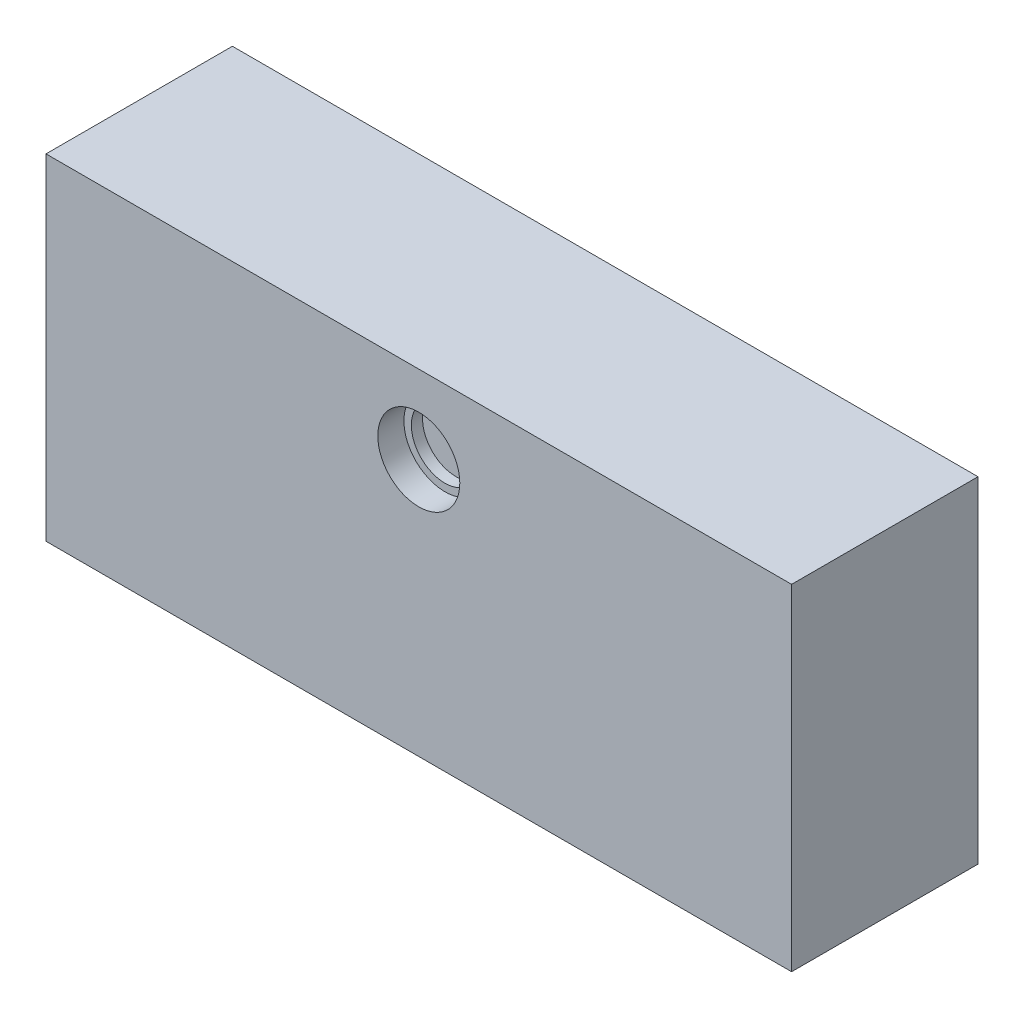
ISO-10303-21;
HEADER;
FILE_DESCRIPTION(('STEP AP214'),'2;1');
FILE_NAME('part.step','',(''),(''),'','','');
FILE_SCHEMA(('AUTOMOTIVE_DESIGN { 1 0 10303 214 1 1 1 1 }'));
ENDSEC;
DATA;
#1=APPLICATION_CONTEXT('core data for automotive mechanical design processes');
#2=APPLICATION_PROTOCOL_DEFINITION('international standard','automotive_design',2000,#1);
#3=PRODUCT_CONTEXT('',#1,'mechanical');
#4=PRODUCT('Part','Part','',(#3));
#5=PRODUCT_RELATED_PRODUCT_CATEGORY('part','',(#4));
#6=PRODUCT_DEFINITION_FORMATION('','',#4);
#7=PRODUCT_DEFINITION_CONTEXT('part definition',#1,'design');
#8=PRODUCT_DEFINITION('design','',#6,#7);
#9=PRODUCT_DEFINITION_SHAPE('','',#8);
#10=(LENGTH_UNIT() NAMED_UNIT(*) SI_UNIT(.MILLI.,.METRE.));
#11=(NAMED_UNIT(*) PLANE_ANGLE_UNIT() SI_UNIT($,.RADIAN.));
#12=(NAMED_UNIT(*) SI_UNIT($,.STERADIAN.) SOLID_ANGLE_UNIT());
#13=UNCERTAINTY_MEASURE_WITH_UNIT(LENGTH_MEASURE(1.E-05),#10,'distance_accuracy_value','');
#14=(GEOMETRIC_REPRESENTATION_CONTEXT(3) GLOBAL_UNCERTAINTY_ASSIGNED_CONTEXT((#13)) GLOBAL_UNIT_ASSIGNED_CONTEXT((#10,
#11,#12)) REPRESENTATION_CONTEXT('',''));
#15=CARTESIAN_POINT('',(0.,0.,0.));
#16=DIRECTION('',(0.,0.,1.));
#17=DIRECTION('',(1.,0.,0.));
#18=AXIS2_PLACEMENT_3D('',#15,#16,#17);
#19=CARTESIAN_POINT('',(-100.,-45.,25.));
#20=DIRECTION('',(1.,0.,0.));
#21=DIRECTION('',(0.,0.,-1.));
#22=AXIS2_PLACEMENT_3D('',#19,#20,#21);
#23=PLANE('',#22);
#24=DIRECTION('',(0.,-1.,0.));
#25=VECTOR('',#24,1.);
#26=CARTESIAN_POINT('',(-100.,-45.,-25.));
#27=LINE('',#26,#25);
#28=CARTESIAN_POINT('',(-100.,45.,-25.));
#29=VERTEX_POINT('',#28);
#30=CARTESIAN_POINT('',(-100.,-45.,-25.));
#31=VERTEX_POINT('',#30);
#32=EDGE_CURVE('E101',#29,#31,#27,.T.);
#33=ORIENTED_EDGE('',*,*,#32,.T.);
#34=DIRECTION('',(0.,0.,-1.));
#35=VECTOR('',#34,1.);
#36=CARTESIAN_POINT('',(-100.,-45.,25.));
#37=LINE('',#36,#35);
#38=CARTESIAN_POINT('',(-100.,-45.,25.));
#39=VERTEX_POINT('',#38);
#40=EDGE_CURVE('E11',#39,#31,#37,.T.);
#41=ORIENTED_EDGE('',*,*,#40,.F.);
#42=DIRECTION('',(0.,-1.,0.));
#43=VECTOR('',#42,1.);
#44=CARTESIAN_POINT('',(-100.,-45.,25.));
#45=LINE('',#44,#43);
#46=CARTESIAN_POINT('',(-100.,45.,25.));
#47=VERTEX_POINT('',#46);
#48=EDGE_CURVE('E89',#47,#39,#45,.T.);
#49=ORIENTED_EDGE('',*,*,#48,.F.);
#50=DIRECTION('',(0.,0.,-1.));
#51=VECTOR('',#50,1.);
#52=CARTESIAN_POINT('',(-100.,45.,25.));
#53=LINE('',#52,#51);
#54=EDGE_CURVE('E97',#47,#29,#53,.T.);
#55=ORIENTED_EDGE('',*,*,#54,.T.);
#56=EDGE_LOOP('',(#33,#41,#49,#55));
#57=FACE_BOUND('',#56,.T.);
#58=ADVANCED_FACE('F38',(#57),#23,.F.);
#59=CARTESIAN_POINT('',(100.,-45.,25.));
#60=DIRECTION('',(0.,1.,0.));
#61=DIRECTION('',(-1.,0.,0.));
#62=AXIS2_PLACEMENT_3D('',#59,#60,#61);
#63=PLANE('',#62);
#64=CARTESIAN_POINT('',(-50.,-45.,0.));
#65=DIRECTION('',(0.,-1.,0.));
#66=DIRECTION('',(1.,0.,0.));
#67=AXIS2_PLACEMENT_3D('',#64,#65,#66);
#68=CIRCLE('',#67,5.);
#69=CARTESIAN_POINT('',(-45.,-45.,0.));
#70=VERTEX_POINT('',#69);
#71=EDGE_CURVE('E134',#70,#70,#68,.T.);
#72=ORIENTED_EDGE('',*,*,#71,.F.);
#73=EDGE_LOOP('',(#72));
#74=FACE_BOUND('',#73,.T.);
#75=CARTESIAN_POINT('',(50.,-45.,0.));
#76=DIRECTION('',(0.,-1.,0.));
#77=DIRECTION('',(1.,0.,0.));
#78=AXIS2_PLACEMENT_3D('',#75,#76,#77);
#79=CIRCLE('',#78,5.);
#80=CARTESIAN_POINT('',(55.,-45.,0.));
#81=VERTEX_POINT('',#80);
#82=EDGE_CURVE('E127',#81,#81,#79,.T.);
#83=ORIENTED_EDGE('',*,*,#82,.F.);
#84=EDGE_LOOP('',(#83));
#85=FACE_BOUND('',#84,.T.);
#86=DIRECTION('',(1.,0.,0.));
#87=VECTOR('',#86,1.);
#88=CARTESIAN_POINT('',(100.,-45.,-25.));
#89=LINE('',#88,#87);
#90=CARTESIAN_POINT('',(100.,-45.,-25.));
#91=VERTEX_POINT('',#90);
#92=EDGE_CURVE('E93',#31,#91,#89,.T.);
#93=ORIENTED_EDGE('',*,*,#92,.T.);
#94=DIRECTION('',(0.,0.,-1.));
#95=VECTOR('',#94,1.);
#96=CARTESIAN_POINT('',(100.,-45.,25.));
#97=LINE('',#96,#95);
#98=CARTESIAN_POINT('',(100.,-45.,25.));
#99=VERTEX_POINT('',#98);
#100=EDGE_CURVE('E46',#99,#91,#97,.T.);
#101=ORIENTED_EDGE('',*,*,#100,.F.);
#102=DIRECTION('',(1.,0.,0.));
#103=VECTOR('',#102,1.);
#104=CARTESIAN_POINT('',(100.,-45.,25.));
#105=LINE('',#104,#103);
#106=EDGE_CURVE('E84',#39,#99,#105,.T.);
#107=ORIENTED_EDGE('',*,*,#106,.F.);
#108=ORIENTED_EDGE('',*,*,#40,.T.);
#109=EDGE_LOOP('',(#93,#101,#107,#108));
#110=FACE_BOUND('',#109,.T.);
#111=ADVANCED_FACE('F92',(#74,#85,#110),#63,.F.);
#112=CARTESIAN_POINT('',(100.,-45.,25.));
#113=DIRECTION('',(-1.,0.,0.));
#114=DIRECTION('',(0.,0.,1.));
#115=AXIS2_PLACEMENT_3D('',#112,#113,#114);
#116=PLANE('',#115);
#117=DIRECTION('',(0.,1.,0.));
#118=VECTOR('',#117,1.);
#119=CARTESIAN_POINT('',(100.,-45.,-25.));
#120=LINE('',#119,#118);
#121=CARTESIAN_POINT('',(100.,45.,-25.));
#122=VERTEX_POINT('',#121);
#123=EDGE_CURVE('E71',#91,#122,#120,.T.);
#124=ORIENTED_EDGE('',*,*,#123,.T.);
#125=DIRECTION('',(0.,0.,-1.));
#126=VECTOR('',#125,1.);
#127=CARTESIAN_POINT('',(100.,45.,25.));
#128=LINE('',#127,#126);
#129=CARTESIAN_POINT('',(100.,45.,25.));
#130=VERTEX_POINT('',#129);
#131=EDGE_CURVE('E94',#130,#122,#128,.T.);
#132=ORIENTED_EDGE('',*,*,#131,.F.);
#133=DIRECTION('',(0.,1.,0.));
#134=VECTOR('',#133,1.);
#135=CARTESIAN_POINT('',(100.,-45.,25.));
#136=LINE('',#135,#134);
#137=EDGE_CURVE('E87',#99,#130,#136,.T.);
#138=ORIENTED_EDGE('',*,*,#137,.F.);
#139=ORIENTED_EDGE('',*,*,#100,.T.);
#140=EDGE_LOOP('',(#124,#132,#138,#139));
#141=FACE_BOUND('',#140,.T.);
#142=ADVANCED_FACE('F95',(#141),#116,.F.);
#143=CARTESIAN_POINT('',(100.,45.,25.));
#144=DIRECTION('',(0.,-1.,0.));
#145=DIRECTION('',(1.,0.,0.));
#146=AXIS2_PLACEMENT_3D('',#143,#144,#145);
#147=PLANE('',#146);
#148=DIRECTION('',(-1.,0.,0.));
#149=VECTOR('',#148,1.);
#150=CARTESIAN_POINT('',(100.,45.,-25.));
#151=LINE('',#150,#149);
#152=EDGE_CURVE('E77',#122,#29,#151,.T.);
#153=ORIENTED_EDGE('',*,*,#152,.T.);
#154=ORIENTED_EDGE('',*,*,#54,.F.);
#155=DIRECTION('',(-1.,0.,0.));
#156=VECTOR('',#155,1.);
#157=CARTESIAN_POINT('',(100.,45.,25.));
#158=LINE('',#157,#156);
#159=EDGE_CURVE('E54',#130,#47,#158,.T.);
#160=ORIENTED_EDGE('',*,*,#159,.F.);
#161=ORIENTED_EDGE('',*,*,#131,.T.);
#162=EDGE_LOOP('',(#153,#154,#160,#161));
#163=FACE_BOUND('',#162,.T.);
#164=ADVANCED_FACE('F109',(#163),#147,.F.);
#165=CARTESIAN_POINT('',(0.,0.,25.));
#166=DIRECTION('',(0.,0.,1.));
#167=DIRECTION('',(1.,0.,0.));
#168=AXIS2_PLACEMENT_3D('',#165,#166,#167);
#169=PLANE('',#168);
#170=CARTESIAN_POINT('',(0.,24.,25.));
#171=DIRECTION('',(0.,0.,1.));
#172=DIRECTION('',(1.,0.,0.));
#173=AXIS2_PLACEMENT_3D('',#170,#171,#172);
#174=CIRCLE('',#173,11.);
#175=CARTESIAN_POINT('',(11.,24.,25.));
#176=VERTEX_POINT('',#175);
#177=EDGE_CURVE('E118',#176,#176,#174,.T.);
#178=ORIENTED_EDGE('',*,*,#177,.F.);
#179=EDGE_LOOP('',(#178));
#180=FACE_BOUND('',#179,.T.);
#181=ORIENTED_EDGE('',*,*,#48,.T.);
#182=ORIENTED_EDGE('',*,*,#106,.T.);
#183=ORIENTED_EDGE('',*,*,#137,.T.);
#184=ORIENTED_EDGE('',*,*,#159,.T.);
#185=EDGE_LOOP('',(#181,#182,#183,#184));
#186=FACE_BOUND('',#185,.T.);
#187=ADVANCED_FACE('F85',(#180,#186),#169,.T.);
#188=CARTESIAN_POINT('',(0.,0.,-25.));
#189=DIRECTION('',(0.,0.,1.));
#190=DIRECTION('',(1.,0.,0.));
#191=AXIS2_PLACEMENT_3D('',#188,#189,#190);
#192=PLANE('',#191);
#193=CARTESIAN_POINT('',(50.,-5.00000000000001,-25.));
#194=DIRECTION('',(0.,0.,-1.));
#195=DIRECTION('',(-1.,0.,0.));
#196=AXIS2_PLACEMENT_3D('',#193,#194,#195);
#197=CIRCLE('',#196,5.);
#198=CARTESIAN_POINT('',(45.,-5.00000000000001,-25.));
#199=VERTEX_POINT('',#198);
#200=EDGE_CURVE('E145',#199,#199,#197,.T.);
#201=ORIENTED_EDGE('',*,*,#200,.F.);
#202=EDGE_LOOP('',(#201));
#203=FACE_BOUND('',#202,.T.);
#204=CARTESIAN_POINT('',(-50.,-5.00000000000001,-25.));
#205=DIRECTION('',(0.,0.,-1.));
#206=DIRECTION('',(-1.,0.,0.));
#207=AXIS2_PLACEMENT_3D('',#204,#205,#206);
#208=CIRCLE('',#207,5.);
#209=CARTESIAN_POINT('',(-55.,-5.00000000000001,-25.));
#210=VERTEX_POINT('',#209);
#211=EDGE_CURVE('E139',#210,#210,#208,.T.);
#212=ORIENTED_EDGE('',*,*,#211,.F.);
#213=EDGE_LOOP('',(#212));
#214=FACE_BOUND('',#213,.T.);
#215=ORIENTED_EDGE('',*,*,#32,.F.);
#216=ORIENTED_EDGE('',*,*,#152,.F.);
#217=ORIENTED_EDGE('',*,*,#123,.F.);
#218=ORIENTED_EDGE('',*,*,#92,.F.);
#219=EDGE_LOOP('',(#215,#216,#217,#218));
#220=FACE_BOUND('',#219,.T.);
#221=ADVANCED_FACE('F112',(#203,#214,#220),#192,.F.);
#222=CARTESIAN_POINT('',(0.,24.,18.));
#223=DIRECTION('',(0.,0.,1.));
#224=DIRECTION('',(1.,0.,0.));
#225=AXIS2_PLACEMENT_3D('',#222,#223,#224);
#226=CYLINDRICAL_SURFACE('',#225,11.);
#227=CARTESIAN_POINT('',(0.,24.,18.));
#228=DIRECTION('',(0.,0.,1.));
#229=DIRECTION('',(1.,0.,0.));
#230=AXIS2_PLACEMENT_3D('',#227,#228,#229);
#231=CIRCLE('',#230,11.);
#232=CARTESIAN_POINT('',(11.,24.,18.));
#233=VERTEX_POINT('',#232);
#234=EDGE_CURVE('E117',#233,#233,#231,.T.);
#235=ORIENTED_EDGE('',*,*,#234,.F.);
#236=EDGE_LOOP('',(#235));
#237=FACE_BOUND('',#236,.T.);
#238=ORIENTED_EDGE('',*,*,#177,.T.);
#239=EDGE_LOOP('',(#238));
#240=FACE_BOUND('',#239,.T.);
#241=ADVANCED_FACE('F162',(#237,#240),#226,.F.);
#242=CARTESIAN_POINT('',(0.,24.,18.));
#243=DIRECTION('',(0.,0.,1.));
#244=DIRECTION('',(1.,0.,0.));
#245=AXIS2_PLACEMENT_3D('',#242,#243,#244);
#246=PLANE('',#245);
#247=CARTESIAN_POINT('',(0.,24.,18.));
#248=DIRECTION('',(0.,0.,1.));
#249=DIRECTION('',(1.,0.,0.));
#250=AXIS2_PLACEMENT_3D('',#247,#248,#249);
#251=CIRCLE('',#250,9.);
#252=CARTESIAN_POINT('',(9.,24.,18.));
#253=VERTEX_POINT('',#252);
#254=EDGE_CURVE('E121',#253,#253,#251,.T.);
#255=ORIENTED_EDGE('',*,*,#254,.F.);
#256=EDGE_LOOP('',(#255));
#257=FACE_BOUND('',#256,.T.);
#258=ORIENTED_EDGE('',*,*,#234,.T.);
#259=EDGE_LOOP('',(#258));
#260=FACE_BOUND('',#259,.T.);
#261=ADVANCED_FACE('F206',(#257,#260),#246,.T.);
#262=CARTESIAN_POINT('',(0.,24.,15.));
#263=DIRECTION('',(0.,0.,1.));
#264=DIRECTION('',(1.,0.,0.));
#265=AXIS2_PLACEMENT_3D('',#262,#263,#264);
#266=PLANE('',#265);
#267=CARTESIAN_POINT('',(0.,24.,15.));
#268=DIRECTION('',(0.,0.,1.));
#269=DIRECTION('',(1.,0.,0.));
#270=AXIS2_PLACEMENT_3D('',#267,#268,#269);
#271=CIRCLE('',#270,9.);
#272=CARTESIAN_POINT('',(9.,24.,15.));
#273=VERTEX_POINT('',#272);
#274=EDGE_CURVE('E104',#273,#273,#271,.T.);
#275=ORIENTED_EDGE('',*,*,#274,.T.);
#276=EDGE_LOOP('',(#275));
#277=FACE_BOUND('',#276,.T.);
#278=ADVANCED_FACE('F202',(#277),#266,.T.);
#279=CARTESIAN_POINT('',(0.,24.,15.));
#280=DIRECTION('',(0.,0.,1.));
#281=DIRECTION('',(1.,0.,0.));
#282=AXIS2_PLACEMENT_3D('',#279,#280,#281);
#283=CYLINDRICAL_SURFACE('',#282,9.);
#284=ORIENTED_EDGE('',*,*,#274,.F.);
#285=EDGE_LOOP('',(#284));
#286=FACE_BOUND('',#285,.T.);
#287=ORIENTED_EDGE('',*,*,#254,.T.);
#288=EDGE_LOOP('',(#287));
#289=FACE_BOUND('',#288,.T.);
#290=ADVANCED_FACE('F198',(#286,#289),#283,.F.);
#291=CARTESIAN_POINT('',(50.,-30.,0.));
#292=DIRECTION('',(0.,-1.,0.));
#293=DIRECTION('',(1.,0.,0.));
#294=AXIS2_PLACEMENT_3D('',#291,#292,#293);
#295=CYLINDRICAL_SURFACE('',#294,5.);
#296=CARTESIAN_POINT('',(50.,-30.,0.));
#297=DIRECTION('',(0.,-1.,0.));
#298=DIRECTION('',(1.,0.,0.));
#299=AXIS2_PLACEMENT_3D('',#296,#297,#298);
#300=CIRCLE('',#299,5.);
#301=CARTESIAN_POINT('',(55.,-30.,0.));
#302=VERTEX_POINT('',#301);
#303=EDGE_CURVE('E130',#302,#302,#300,.T.);
#304=ORIENTED_EDGE('',*,*,#303,.F.);
#305=EDGE_LOOP('',(#304));
#306=FACE_BOUND('',#305,.T.);
#307=ORIENTED_EDGE('',*,*,#82,.T.);
#308=EDGE_LOOP('',(#307));
#309=FACE_BOUND('',#308,.T.);
#310=ADVANCED_FACE('F201',(#306,#309),#295,.F.);
#311=CARTESIAN_POINT('',(50.,-30.,0.));
#312=DIRECTION('',(0.,-1.,0.));
#313=DIRECTION('',(1.,0.,0.));
#314=AXIS2_PLACEMENT_3D('',#311,#312,#313);
#315=PLANE('',#314);
#316=ORIENTED_EDGE('',*,*,#303,.T.);
#317=EDGE_LOOP('',(#316));
#318=FACE_BOUND('',#317,.T.);
#319=ADVANCED_FACE('F216',(#318),#315,.T.);
#320=CARTESIAN_POINT('',(-50.,-30.,0.));
#321=DIRECTION('',(0.,-1.,0.));
#322=DIRECTION('',(1.,0.,0.));
#323=AXIS2_PLACEMENT_3D('',#320,#321,#322);
#324=CYLINDRICAL_SURFACE('',#323,5.);
#325=CARTESIAN_POINT('',(-50.,-30.,0.));
#326=DIRECTION('',(0.,-1.,0.));
#327=DIRECTION('',(1.,0.,0.));
#328=AXIS2_PLACEMENT_3D('',#325,#326,#327);
#329=CIRCLE('',#328,5.);
#330=CARTESIAN_POINT('',(-45.,-30.,0.));
#331=VERTEX_POINT('',#330);
#332=EDGE_CURVE('E126',#331,#331,#329,.T.);
#333=ORIENTED_EDGE('',*,*,#332,.F.);
#334=EDGE_LOOP('',(#333));
#335=FACE_BOUND('',#334,.T.);
#336=ORIENTED_EDGE('',*,*,#71,.T.);
#337=EDGE_LOOP('',(#336));
#338=FACE_BOUND('',#337,.T.);
#339=ADVANCED_FACE('F177',(#335,#338),#324,.F.);
#340=CARTESIAN_POINT('',(-50.,-30.,0.));
#341=DIRECTION('',(0.,-1.,0.));
#342=DIRECTION('',(1.,0.,0.));
#343=AXIS2_PLACEMENT_3D('',#340,#341,#342);
#344=PLANE('',#343);
#345=ORIENTED_EDGE('',*,*,#332,.T.);
#346=EDGE_LOOP('',(#345));
#347=FACE_BOUND('',#346,.T.);
#348=ADVANCED_FACE('F168',(#347),#344,.T.);
#349=CARTESIAN_POINT('',(-50.,-5.00000000000001,-10.));
#350=DIRECTION('',(0.,0.,-1.));
#351=DIRECTION('',(-1.,0.,0.));
#352=AXIS2_PLACEMENT_3D('',#349,#350,#351);
#353=CYLINDRICAL_SURFACE('',#352,5.);
#354=CARTESIAN_POINT('',(-50.,-5.00000000000001,-10.));
#355=DIRECTION('',(0.,0.,-1.));
#356=DIRECTION('',(-1.,0.,0.));
#357=AXIS2_PLACEMENT_3D('',#354,#355,#356);
#358=CIRCLE('',#357,5.);
#359=CARTESIAN_POINT('',(-55.,-5.00000000000001,-10.));
#360=VERTEX_POINT('',#359);
#361=EDGE_CURVE('E142',#360,#360,#358,.T.);
#362=ORIENTED_EDGE('',*,*,#361,.F.);
#363=EDGE_LOOP('',(#362));
#364=FACE_BOUND('',#363,.T.);
#365=ORIENTED_EDGE('',*,*,#211,.T.);
#366=EDGE_LOOP('',(#365));
#367=FACE_BOUND('',#366,.T.);
#368=ADVANCED_FACE('F166',(#364,#367),#353,.F.);
#369=CARTESIAN_POINT('',(-50.,-5.00000000000001,-10.));
#370=DIRECTION('',(0.,0.,-1.));
#371=DIRECTION('',(-1.,0.,0.));
#372=AXIS2_PLACEMENT_3D('',#369,#370,#371);
#373=PLANE('',#372);
#374=ORIENTED_EDGE('',*,*,#361,.T.);
#375=EDGE_LOOP('',(#374));
#376=FACE_BOUND('',#375,.T.);
#377=ADVANCED_FACE('F156',(#376),#373,.T.);
#378=CARTESIAN_POINT('',(50.,-5.00000000000001,-10.));
#379=DIRECTION('',(0.,0.,-1.));
#380=DIRECTION('',(-1.,0.,0.));
#381=AXIS2_PLACEMENT_3D('',#378,#379,#380);
#382=CYLINDRICAL_SURFACE('',#381,5.);
#383=CARTESIAN_POINT('',(50.,-5.00000000000001,-10.));
#384=DIRECTION('',(0.,0.,-1.));
#385=DIRECTION('',(-1.,0.,0.));
#386=AXIS2_PLACEMENT_3D('',#383,#384,#385);
#387=CIRCLE('',#386,5.);
#388=CARTESIAN_POINT('',(45.,-5.00000000000001,-10.));
#389=VERTEX_POINT('',#388);
#390=EDGE_CURVE('E131',#389,#389,#387,.T.);
#391=ORIENTED_EDGE('',*,*,#390,.F.);
#392=EDGE_LOOP('',(#391));
#393=FACE_BOUND('',#392,.T.);
#394=ORIENTED_EDGE('',*,*,#200,.T.);
#395=EDGE_LOOP('',(#394));
#396=FACE_BOUND('',#395,.T.);
#397=ADVANCED_FACE('F153',(#393,#396),#382,.F.);
#398=CARTESIAN_POINT('',(50.,-5.00000000000001,-10.));
#399=DIRECTION('',(0.,0.,-1.));
#400=DIRECTION('',(-1.,0.,0.));
#401=AXIS2_PLACEMENT_3D('',#398,#399,#400);
#402=PLANE('',#401);
#403=ORIENTED_EDGE('',*,*,#390,.T.);
#404=EDGE_LOOP('',(#403));
#405=FACE_BOUND('',#404,.T.);
#406=ADVANCED_FACE('F151',(#405),#402,.T.);
#407=CLOSED_SHELL('',(#58,#111,#142,#164,#187,#221,#241,#261,#278,#290,#310,#319,#339,#348,#368,
#377,#397,#406));
#408=MANIFOLD_SOLID_BREP('B2',#407);
#409=ADVANCED_BREP_SHAPE_REPRESENTATION('',(#18,#408),#14);
#410=SHAPE_DEFINITION_REPRESENTATION(#9,#409);
ENDSEC;
END-ISO-10303-21;
